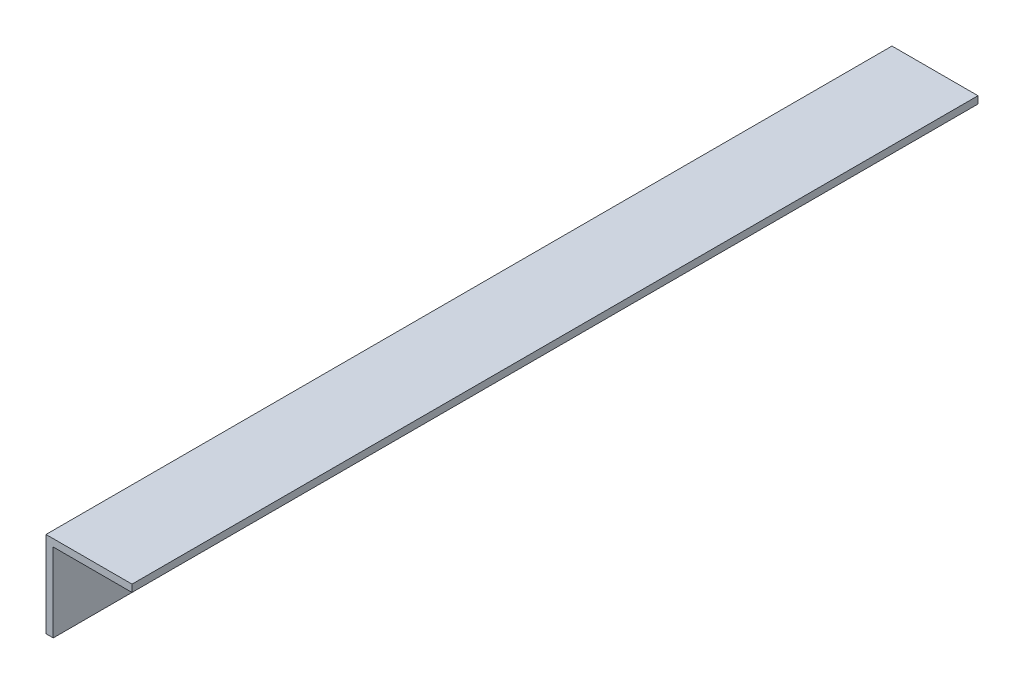
ISO-10303-21;
HEADER;
FILE_DESCRIPTION(('STEP AP214'),'2;1');
FILE_NAME('part.step','',(''),(''),'','','');
FILE_SCHEMA(('AUTOMOTIVE_DESIGN { 1 0 10303 214 1 1 1 1 }'));
ENDSEC;
DATA;
#1=APPLICATION_CONTEXT('core data for automotive mechanical design processes');
#2=APPLICATION_PROTOCOL_DEFINITION('international standard','automotive_design',2000,#1);
#3=PRODUCT_CONTEXT('',#1,'mechanical');
#4=PRODUCT('Part','Part','',(#3));
#5=PRODUCT_RELATED_PRODUCT_CATEGORY('part','',(#4));
#6=PRODUCT_DEFINITION_FORMATION('','',#4);
#7=PRODUCT_DEFINITION_CONTEXT('part definition',#1,'design');
#8=PRODUCT_DEFINITION('design','',#6,#7);
#9=PRODUCT_DEFINITION_SHAPE('','',#8);
#10=(LENGTH_UNIT() NAMED_UNIT(*) SI_UNIT(.MILLI.,.METRE.));
#11=(NAMED_UNIT(*) PLANE_ANGLE_UNIT() SI_UNIT($,.RADIAN.));
#12=(NAMED_UNIT(*) SI_UNIT($,.STERADIAN.) SOLID_ANGLE_UNIT());
#13=UNCERTAINTY_MEASURE_WITH_UNIT(LENGTH_MEASURE(1.E-05),#10,'distance_accuracy_value','');
#14=(GEOMETRIC_REPRESENTATION_CONTEXT(3) GLOBAL_UNCERTAINTY_ASSIGNED_CONTEXT((#13)) GLOBAL_UNIT_ASSIGNED_CONTEXT((#10,
#11,#12)) REPRESENTATION_CONTEXT('',''));
#15=CARTESIAN_POINT('',(0.,0.,0.));
#16=DIRECTION('',(0.,0.,1.));
#17=DIRECTION('',(1.,0.,0.));
#18=AXIS2_PLACEMENT_3D('',#15,#16,#17);
#19=CARTESIAN_POINT('',(1.6002,0.,187.325));
#20=DIRECTION('',(0.,1.,0.));
#21=DIRECTION('',(0.,0.,1.));
#22=AXIS2_PLACEMENT_3D('',#19,#20,#21);
#23=PLANE('',#22);
#24=DIRECTION('',(1.,0.,0.));
#25=VECTOR('',#24,1.);
#26=CARTESIAN_POINT('',(1.6002,0.,0.));
#27=LINE('',#26,#25);
#28=CARTESIAN_POINT('',(0.,0.,0.));
#29=VERTEX_POINT('',#28);
#30=CARTESIAN_POINT('',(1.6002,0.,0.));
#31=VERTEX_POINT('',#30);
#32=EDGE_CURVE('E119',#29,#31,#27,.T.);
#33=ORIENTED_EDGE('',*,*,#32,.T.);
#34=DIRECTION('',(0.,0.,-1.));
#35=VECTOR('',#34,1.);
#36=CARTESIAN_POINT('',(1.6002,0.,187.325));
#37=LINE('',#36,#35);
#38=CARTESIAN_POINT('',(1.6002,0.,187.325));
#39=VERTEX_POINT('',#38);
#40=EDGE_CURVE('E11',#39,#31,#37,.T.);
#41=ORIENTED_EDGE('',*,*,#40,.F.);
#42=DIRECTION('',(1.,0.,0.));
#43=VECTOR('',#42,1.);
#44=CARTESIAN_POINT('',(1.6002,0.,187.325));
#45=LINE('',#44,#43);
#46=CARTESIAN_POINT('',(0.,0.,187.325));
#47=VERTEX_POINT('',#46);
#48=EDGE_CURVE('E129',#47,#39,#45,.T.);
#49=ORIENTED_EDGE('',*,*,#48,.F.);
#50=DIRECTION('',(0.,0.,-1.));
#51=VECTOR('',#50,1.);
#52=CARTESIAN_POINT('',(0.,0.,187.325));
#53=LINE('',#52,#51);
#54=EDGE_CURVE('E115',#47,#29,#53,.T.);
#55=ORIENTED_EDGE('',*,*,#54,.T.);
#56=EDGE_LOOP('',(#33,#41,#49,#55));
#57=FACE_BOUND('',#56,.T.);
#58=ADVANCED_FACE('F35',(#57),#23,.F.);
#59=CARTESIAN_POINT('',(1.6002,17.4498,187.325));
#60=DIRECTION('',(-1.,0.,0.));
#61=DIRECTION('',(0.,-1.,0.));
#62=AXIS2_PLACEMENT_3D('',#59,#60,#61);
#63=PLANE('',#62);
#64=DIRECTION('',(0.,1.,0.));
#65=VECTOR('',#64,1.);
#66=CARTESIAN_POINT('',(1.6002,17.4498,0.));
#67=LINE('',#66,#65);
#68=CARTESIAN_POINT('',(1.6002,17.4498,0.));
#69=VERTEX_POINT('',#68);
#70=EDGE_CURVE('E122',#31,#69,#67,.T.);
#71=ORIENTED_EDGE('',*,*,#70,.T.);
#72=DIRECTION('',(0.,0.,-1.));
#73=VECTOR('',#72,1.);
#74=CARTESIAN_POINT('',(1.6002,17.4498,187.325));
#75=LINE('',#74,#73);
#76=CARTESIAN_POINT('',(1.6002,17.4498,187.325));
#77=VERTEX_POINT('',#76);
#78=EDGE_CURVE('E43',#77,#69,#75,.T.);
#79=ORIENTED_EDGE('',*,*,#78,.F.);
#80=DIRECTION('',(0.,1.,0.));
#81=VECTOR('',#80,1.);
#82=CARTESIAN_POINT('',(1.6002,17.4498,187.325));
#83=LINE('',#82,#81);
#84=EDGE_CURVE('E88',#39,#77,#83,.T.);
#85=ORIENTED_EDGE('',*,*,#84,.F.);
#86=ORIENTED_EDGE('',*,*,#40,.T.);
#87=EDGE_LOOP('',(#71,#79,#85,#86));
#88=FACE_BOUND('',#87,.T.);
#89=ADVANCED_FACE('F153',(#88),#63,.F.);
#90=CARTESIAN_POINT('',(19.05,17.4498,187.325));
#91=DIRECTION('',(0.,1.,0.));
#92=DIRECTION('',(-1.,0.,0.));
#93=AXIS2_PLACEMENT_3D('',#90,#91,#92);
#94=PLANE('',#93);
#95=DIRECTION('',(1.,0.,0.));
#96=VECTOR('',#95,1.);
#97=CARTESIAN_POINT('',(19.05,17.4498,0.));
#98=LINE('',#97,#96);
#99=CARTESIAN_POINT('',(19.05,17.4498,0.));
#100=VERTEX_POINT('',#99);
#101=EDGE_CURVE('E124',#69,#100,#98,.T.);
#102=ORIENTED_EDGE('',*,*,#101,.T.);
#103=DIRECTION('',(0.,0.,-1.));
#104=VECTOR('',#103,1.);
#105=CARTESIAN_POINT('',(19.05,17.4498,187.325));
#106=LINE('',#105,#104);
#107=CARTESIAN_POINT('',(19.05,17.4498,187.325));
#108=VERTEX_POINT('',#107);
#109=EDGE_CURVE('E110',#108,#100,#106,.T.);
#110=ORIENTED_EDGE('',*,*,#109,.F.);
#111=DIRECTION('',(1.,0.,0.));
#112=VECTOR('',#111,1.);
#113=CARTESIAN_POINT('',(19.05,17.4498,187.325));
#114=LINE('',#113,#112);
#115=EDGE_CURVE('E101',#77,#108,#114,.T.);
#116=ORIENTED_EDGE('',*,*,#115,.F.);
#117=ORIENTED_EDGE('',*,*,#78,.T.);
#118=EDGE_LOOP('',(#102,#110,#116,#117));
#119=FACE_BOUND('',#118,.T.);
#120=ADVANCED_FACE('F135',(#119),#94,.F.);
#121=CARTESIAN_POINT('',(19.05,19.05,187.325));
#122=DIRECTION('',(-1.,0.,0.));
#123=DIRECTION('',(0.,0.,1.));
#124=AXIS2_PLACEMENT_3D('',#121,#122,#123);
#125=PLANE('',#124);
#126=DIRECTION('',(0.,1.,0.));
#127=VECTOR('',#126,1.);
#128=CARTESIAN_POINT('',(19.05,19.05,0.));
#129=LINE('',#128,#127);
#130=CARTESIAN_POINT('',(19.05,19.05,0.));
#131=VERTEX_POINT('',#130);
#132=EDGE_CURVE('E109',#100,#131,#129,.T.);
#133=ORIENTED_EDGE('',*,*,#132,.T.);
#134=DIRECTION('',(0.,0.,-1.));
#135=VECTOR('',#134,1.);
#136=CARTESIAN_POINT('',(19.05,19.05,187.325));
#137=LINE('',#136,#135);
#138=CARTESIAN_POINT('',(19.05,19.05,187.325));
#139=VERTEX_POINT('',#138);
#140=EDGE_CURVE('E106',#139,#131,#137,.T.);
#141=ORIENTED_EDGE('',*,*,#140,.F.);
#142=DIRECTION('',(0.,1.,0.));
#143=VECTOR('',#142,1.);
#144=CARTESIAN_POINT('',(19.05,19.05,187.325));
#145=LINE('',#144,#143);
#146=EDGE_CURVE('E95',#108,#139,#145,.T.);
#147=ORIENTED_EDGE('',*,*,#146,.F.);
#148=ORIENTED_EDGE('',*,*,#109,.T.);
#149=EDGE_LOOP('',(#133,#141,#147,#148));
#150=FACE_BOUND('',#149,.T.);
#151=ADVANCED_FACE('F107',(#150),#125,.F.);
#152=CARTESIAN_POINT('',(0.,19.05,187.325));
#153=DIRECTION('',(0.,-1.,0.));
#154=DIRECTION('',(0.,0.,-1.));
#155=AXIS2_PLACEMENT_3D('',#152,#153,#154);
#156=PLANE('',#155);
#157=DIRECTION('',(-1.,0.,0.));
#158=VECTOR('',#157,1.);
#159=CARTESIAN_POINT('',(0.,19.05,0.));
#160=LINE('',#159,#158);
#161=CARTESIAN_POINT('',(0.,19.05,0.));
#162=VERTEX_POINT('',#161);
#163=EDGE_CURVE('E74',#131,#162,#160,.T.);
#164=ORIENTED_EDGE('',*,*,#163,.T.);
#165=DIRECTION('',(0.,0.,-1.));
#166=VECTOR('',#165,1.);
#167=CARTESIAN_POINT('',(0.,19.05,187.325));
#168=LINE('',#167,#166);
#169=CARTESIAN_POINT('',(0.,19.05,187.325));
#170=VERTEX_POINT('',#169);
#171=EDGE_CURVE('E111',#170,#162,#168,.T.);
#172=ORIENTED_EDGE('',*,*,#171,.F.);
#173=DIRECTION('',(-1.,0.,0.));
#174=VECTOR('',#173,1.);
#175=CARTESIAN_POINT('',(0.,19.05,187.325));
#176=LINE('',#175,#174);
#177=EDGE_CURVE('E99',#139,#170,#176,.T.);
#178=ORIENTED_EDGE('',*,*,#177,.F.);
#179=ORIENTED_EDGE('',*,*,#140,.T.);
#180=EDGE_LOOP('',(#164,#172,#178,#179));
#181=FACE_BOUND('',#180,.T.);
#182=ADVANCED_FACE('F113',(#181),#156,.F.);
#183=CARTESIAN_POINT('',(0.,0.,187.325));
#184=DIRECTION('',(1.,0.,0.));
#185=DIRECTION('',(0.,0.,-1.));
#186=AXIS2_PLACEMENT_3D('',#183,#184,#185);
#187=PLANE('',#186);
#188=DIRECTION('',(0.,-1.,0.));
#189=VECTOR('',#188,1.);
#190=CARTESIAN_POINT('',(0.,0.,0.));
#191=LINE('',#190,#189);
#192=EDGE_CURVE('E80',#162,#29,#191,.T.);
#193=ORIENTED_EDGE('',*,*,#192,.T.);
#194=ORIENTED_EDGE('',*,*,#54,.F.);
#195=DIRECTION('',(0.,-1.,0.));
#196=VECTOR('',#195,1.);
#197=CARTESIAN_POINT('',(0.,0.,187.325));
#198=LINE('',#197,#196);
#199=EDGE_CURVE('E51',#170,#47,#198,.T.);
#200=ORIENTED_EDGE('',*,*,#199,.F.);
#201=ORIENTED_EDGE('',*,*,#171,.T.);
#202=EDGE_LOOP('',(#193,#194,#200,#201));
#203=FACE_BOUND('',#202,.T.);
#204=ADVANCED_FACE('F142',(#203),#187,.F.);
#205=CARTESIAN_POINT('',(0.,0.,187.325));
#206=DIRECTION('',(0.,0.,-1.));
#207=DIRECTION('',(-1.,0.,0.));
#208=AXIS2_PLACEMENT_3D('',#205,#206,#207);
#209=PLANE('',#208);
#210=ORIENTED_EDGE('',*,*,#48,.T.);
#211=ORIENTED_EDGE('',*,*,#84,.T.);
#212=ORIENTED_EDGE('',*,*,#115,.T.);
#213=ORIENTED_EDGE('',*,*,#146,.T.);
#214=ORIENTED_EDGE('',*,*,#177,.T.);
#215=ORIENTED_EDGE('',*,*,#199,.T.);
#216=EDGE_LOOP('',(#210,#211,#212,#213,#214,#215));
#217=FACE_BOUND('',#216,.T.);
#218=ADVANCED_FACE('F97',(#217),#209,.F.);
#219=CARTESIAN_POINT('',(0.,0.,0.));
#220=DIRECTION('',(0.,0.,-1.));
#221=DIRECTION('',(-1.,0.,0.));
#222=AXIS2_PLACEMENT_3D('',#219,#220,#221);
#223=PLANE('',#222);
#224=ORIENTED_EDGE('',*,*,#32,.F.);
#225=ORIENTED_EDGE('',*,*,#192,.F.);
#226=ORIENTED_EDGE('',*,*,#163,.F.);
#227=ORIENTED_EDGE('',*,*,#132,.F.);
#228=ORIENTED_EDGE('',*,*,#101,.F.);
#229=ORIENTED_EDGE('',*,*,#70,.F.);
#230=EDGE_LOOP('',(#224,#225,#226,#227,#228,#229));
#231=FACE_BOUND('',#230,.T.);
#232=ADVANCED_FACE('F138',(#231),#223,.T.);
#233=CLOSED_SHELL('',(#58,#89,#120,#151,#182,#204,#218,#232));
#234=MANIFOLD_SOLID_BREP('B2',#233);
#235=ADVANCED_BREP_SHAPE_REPRESENTATION('',(#18,#234),#14);
#236=SHAPE_DEFINITION_REPRESENTATION(#9,#235);
ENDSEC;
END-ISO-10303-21;
